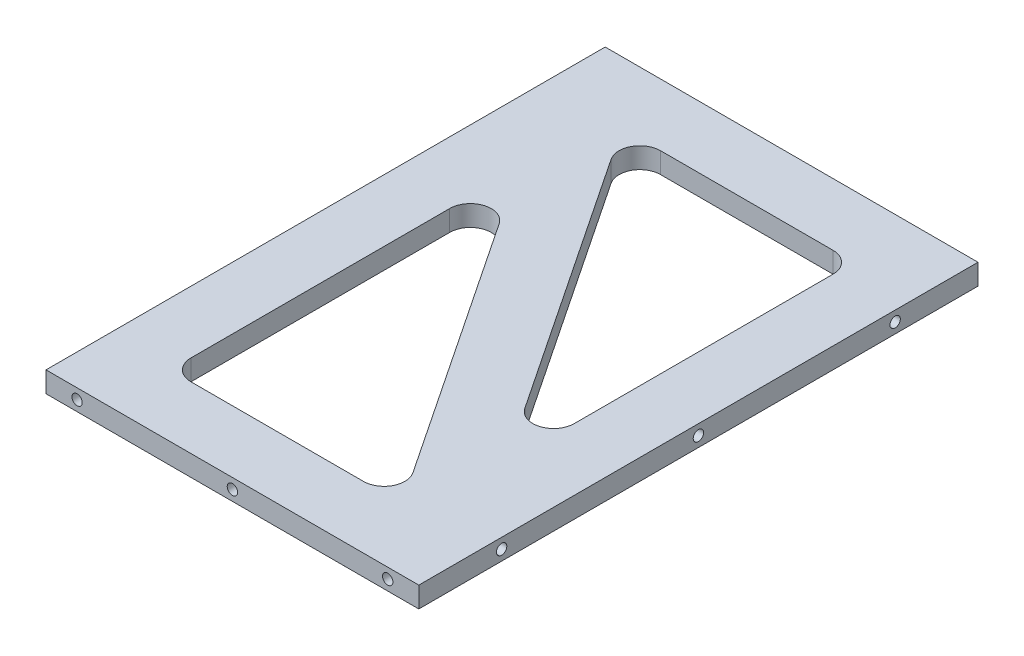
ISO-10303-21;
HEADER;
FILE_DESCRIPTION(('STEP AP214'),'2;1');
FILE_NAME('part.step','',(''),(''),'','','');
FILE_SCHEMA(('AUTOMOTIVE_DESIGN { 1 0 10303 214 1 1 1 1 }'));
ENDSEC;
DATA;
#1=APPLICATION_CONTEXT('core data for automotive mechanical design processes');
#2=APPLICATION_PROTOCOL_DEFINITION('international standard','automotive_design',2000,#1);
#3=PRODUCT_CONTEXT('',#1,'mechanical');
#4=PRODUCT('Part','Part','',(#3));
#5=PRODUCT_RELATED_PRODUCT_CATEGORY('part','',(#4));
#6=PRODUCT_DEFINITION_FORMATION('','',#4);
#7=PRODUCT_DEFINITION_CONTEXT('part definition',#1,'design');
#8=PRODUCT_DEFINITION('design','',#6,#7);
#9=PRODUCT_DEFINITION_SHAPE('','',#8);
#10=(LENGTH_UNIT() NAMED_UNIT(*) SI_UNIT(.MILLI.,.METRE.));
#11=(NAMED_UNIT(*) PLANE_ANGLE_UNIT() SI_UNIT($,.RADIAN.));
#12=(NAMED_UNIT(*) SI_UNIT($,.STERADIAN.) SOLID_ANGLE_UNIT());
#13=UNCERTAINTY_MEASURE_WITH_UNIT(LENGTH_MEASURE(1.E-05),#10,'distance_accuracy_value','');
#14=(GEOMETRIC_REPRESENTATION_CONTEXT(3) GLOBAL_UNCERTAINTY_ASSIGNED_CONTEXT((#13)) GLOBAL_UNIT_ASSIGNED_CONTEXT((#10,
#11,#12)) REPRESENTATION_CONTEXT('',''));
#15=CARTESIAN_POINT('',(0.,0.,0.));
#16=DIRECTION('',(0.,0.,1.));
#17=DIRECTION('',(1.,0.,0.));
#18=AXIS2_PLACEMENT_3D('',#15,#16,#17);
#19=CARTESIAN_POINT('',(0.,10.,0.));
#20=DIRECTION('',(1.,0.,0.));
#21=DIRECTION('',(0.,0.,-1.));
#22=AXIS2_PLACEMENT_3D('',#19,#20,#21);
#23=PLANE('',#22);
#24=DIRECTION('',(0.,0.,1.));
#25=VECTOR('',#24,1.);
#26=CARTESIAN_POINT('',(0.,0.,0.));
#27=LINE('',#26,#25);
#28=CARTESIAN_POINT('',(0.,0.,-270.));
#29=VERTEX_POINT('',#28);
#30=CARTESIAN_POINT('',(0.,0.,0.));
#31=VERTEX_POINT('',#30);
#32=EDGE_CURVE('E264',#29,#31,#27,.T.);
#33=ORIENTED_EDGE('',*,*,#32,.T.);
#34=DIRECTION('',(0.,-1.,0.));
#35=VECTOR('',#34,1.);
#36=CARTESIAN_POINT('',(0.,10.,0.));
#37=LINE('',#36,#35);
#38=CARTESIAN_POINT('',(0.,10.,0.));
#39=VERTEX_POINT('',#38);
#40=EDGE_CURVE('E298',#39,#31,#37,.T.);
#41=ORIENTED_EDGE('',*,*,#40,.F.);
#42=DIRECTION('',(0.,0.,1.));
#43=VECTOR('',#42,1.);
#44=CARTESIAN_POINT('',(0.,10.,0.));
#45=LINE('',#44,#43);
#46=CARTESIAN_POINT('',(0.,10.,-270.));
#47=VERTEX_POINT('',#46);
#48=EDGE_CURVE('E272',#47,#39,#45,.T.);
#49=ORIENTED_EDGE('',*,*,#48,.F.);
#50=DIRECTION('',(0.,-1.,0.));
#51=VECTOR('',#50,1.);
#52=CARTESIAN_POINT('',(0.,10.,-270.));
#53=LINE('',#52,#51);
#54=EDGE_CURVE('E282',#47,#29,#53,.T.);
#55=ORIENTED_EDGE('',*,*,#54,.T.);
#56=EDGE_LOOP('',(#33,#41,#49,#55));
#57=FACE_BOUND('',#56,.T.);
#58=ADVANCED_FACE('F37',(#57),#23,.F.);
#59=CARTESIAN_POINT('',(0.,10.,0.));
#60=DIRECTION('',(0.,0.,-1.));
#61=DIRECTION('',(-1.,0.,0.));
#62=AXIS2_PLACEMENT_3D('',#59,#60,#61);
#63=PLANE('',#62);
#64=CARTESIAN_POINT('',(15.,5.,0.));
#65=DIRECTION('',(0.,0.,1.));
#66=DIRECTION('',(1.,0.,0.));
#67=AXIS2_PLACEMENT_3D('',#64,#65,#66);
#68=CIRCLE('',#67,2.49999999999999);
#69=CARTESIAN_POINT('',(17.5,5.,0.));
#70=VERTEX_POINT('',#69);
#71=EDGE_CURVE('E220',#70,#70,#68,.T.);
#72=ORIENTED_EDGE('',*,*,#71,.F.);
#73=EDGE_LOOP('',(#72));
#74=FACE_BOUND('',#73,.T.);
#75=CARTESIAN_POINT('',(90.,5.,0.));
#76=DIRECTION('',(0.,0.,1.));
#77=DIRECTION('',(1.,0.,0.));
#78=AXIS2_PLACEMENT_3D('',#75,#76,#77);
#79=CIRCLE('',#78,2.49999999999999);
#80=CARTESIAN_POINT('',(92.5,5.,0.));
#81=VERTEX_POINT('',#80);
#82=EDGE_CURVE('E226',#81,#81,#79,.T.);
#83=ORIENTED_EDGE('',*,*,#82,.F.);
#84=EDGE_LOOP('',(#83));
#85=FACE_BOUND('',#84,.T.);
#86=CARTESIAN_POINT('',(165.,5.,0.));
#87=DIRECTION('',(0.,0.,1.));
#88=DIRECTION('',(1.,0.,0.));
#89=AXIS2_PLACEMENT_3D('',#86,#87,#88);
#90=CIRCLE('',#89,2.5);
#91=CARTESIAN_POINT('',(167.5,5.,0.));
#92=VERTEX_POINT('',#91);
#93=EDGE_CURVE('E232',#92,#92,#90,.T.);
#94=ORIENTED_EDGE('',*,*,#93,.F.);
#95=EDGE_LOOP('',(#94));
#96=FACE_BOUND('',#95,.T.);
#97=DIRECTION('',(1.,0.,0.));
#98=VECTOR('',#97,1.);
#99=CARTESIAN_POINT('',(0.,0.,0.));
#100=LINE('',#99,#98);
#101=CARTESIAN_POINT('',(180.,0.,0.));
#102=VERTEX_POINT('',#101);
#103=EDGE_CURVE('E285',#31,#102,#100,.T.);
#104=ORIENTED_EDGE('',*,*,#103,.T.);
#105=DIRECTION('',(0.,-1.,0.));
#106=VECTOR('',#105,1.);
#107=CARTESIAN_POINT('',(180.,10.,0.));
#108=LINE('',#107,#106);
#109=CARTESIAN_POINT('',(180.,10.,0.));
#110=VERTEX_POINT('',#109);
#111=EDGE_CURVE('E295',#110,#102,#108,.T.);
#112=ORIENTED_EDGE('',*,*,#111,.F.);
#113=DIRECTION('',(1.,0.,0.));
#114=VECTOR('',#113,1.);
#115=CARTESIAN_POINT('',(0.,10.,0.));
#116=LINE('',#115,#114);
#117=EDGE_CURVE('E275',#39,#110,#116,.T.);
#118=ORIENTED_EDGE('',*,*,#117,.F.);
#119=ORIENTED_EDGE('',*,*,#40,.T.);
#120=EDGE_LOOP('',(#104,#112,#118,#119));
#121=FACE_BOUND('',#120,.T.);
#122=ADVANCED_FACE('F390',(#74,#85,#96,#121),#63,.F.);
#123=CARTESIAN_POINT('',(180.,10.,0.));
#124=DIRECTION('',(-1.,0.,0.));
#125=DIRECTION('',(0.,0.,1.));
#126=AXIS2_PLACEMENT_3D('',#123,#124,#125);
#127=PLANE('',#126);
#128=CARTESIAN_POINT('',(180.,5.,-40.));
#129=DIRECTION('',(1.,0.,0.));
#130=DIRECTION('',(0.,0.,-1.));
#131=AXIS2_PLACEMENT_3D('',#128,#129,#130);
#132=CIRCLE('',#131,2.49999999999999);
#133=CARTESIAN_POINT('',(180.,5.,-42.5));
#134=VERTEX_POINT('',#133);
#135=EDGE_CURVE('E186',#134,#134,#132,.T.);
#136=ORIENTED_EDGE('',*,*,#135,.F.);
#137=EDGE_LOOP('',(#136));
#138=FACE_BOUND('',#137,.T.);
#139=CARTESIAN_POINT('',(180.,5.,-135.));
#140=DIRECTION('',(1.,0.,0.));
#141=DIRECTION('',(0.,0.,-1.));
#142=AXIS2_PLACEMENT_3D('',#139,#140,#141);
#143=CIRCLE('',#142,2.49999999999999);
#144=CARTESIAN_POINT('',(180.,5.,-137.5));
#145=VERTEX_POINT('',#144);
#146=EDGE_CURVE('E185',#145,#145,#143,.T.);
#147=ORIENTED_EDGE('',*,*,#146,.F.);
#148=EDGE_LOOP('',(#147));
#149=FACE_BOUND('',#148,.T.);
#150=CARTESIAN_POINT('',(180.,5.,-230.));
#151=DIRECTION('',(1.,0.,0.));
#152=DIRECTION('',(0.,0.,-1.));
#153=AXIS2_PLACEMENT_3D('',#150,#151,#152);
#154=CIRCLE('',#153,2.49999999999999);
#155=CARTESIAN_POINT('',(180.,5.,-232.5));
#156=VERTEX_POINT('',#155);
#157=EDGE_CURVE('E196',#156,#156,#154,.T.);
#158=ORIENTED_EDGE('',*,*,#157,.F.);
#159=EDGE_LOOP('',(#158));
#160=FACE_BOUND('',#159,.T.);
#161=DIRECTION('',(0.,0.,-1.));
#162=VECTOR('',#161,1.);
#163=CARTESIAN_POINT('',(180.,0.,0.));
#164=LINE('',#163,#162);
#165=CARTESIAN_POINT('',(180.,0.,-270.));
#166=VERTEX_POINT('',#165);
#167=EDGE_CURVE('E287',#102,#166,#164,.T.);
#168=ORIENTED_EDGE('',*,*,#167,.T.);
#169=DIRECTION('',(0.,-1.,0.));
#170=VECTOR('',#169,1.);
#171=CARTESIAN_POINT('',(180.,10.,-270.));
#172=LINE('',#171,#170);
#173=CARTESIAN_POINT('',(180.,10.,-270.));
#174=VERTEX_POINT('',#173);
#175=EDGE_CURVE('E292',#174,#166,#172,.T.);
#176=ORIENTED_EDGE('',*,*,#175,.F.);
#177=DIRECTION('',(0.,0.,-1.));
#178=VECTOR('',#177,1.);
#179=CARTESIAN_POINT('',(180.,10.,0.));
#180=LINE('',#179,#178);
#181=EDGE_CURVE('E278',#110,#174,#180,.T.);
#182=ORIENTED_EDGE('',*,*,#181,.F.);
#183=ORIENTED_EDGE('',*,*,#111,.T.);
#184=EDGE_LOOP('',(#168,#176,#182,#183));
#185=FACE_BOUND('',#184,.T.);
#186=ADVANCED_FACE('F396',(#138,#149,#160,#185),#127,.F.);
#187=CARTESIAN_POINT('',(0.,10.,-270.));
#188=DIRECTION('',(0.,0.,1.));
#189=DIRECTION('',(1.,0.,0.));
#190=AXIS2_PLACEMENT_3D('',#187,#188,#189);
#191=PLANE('',#190);
#192=CARTESIAN_POINT('',(165.,5.,-270.));
#193=DIRECTION('',(0.,0.,-1.));
#194=DIRECTION('',(-1.,0.,0.));
#195=AXIS2_PLACEMENT_3D('',#192,#193,#194);
#196=CIRCLE('',#195,2.5);
#197=CARTESIAN_POINT('',(162.5,5.,-270.));
#198=VERTEX_POINT('',#197);
#199=EDGE_CURVE('E202',#198,#198,#196,.T.);
#200=ORIENTED_EDGE('',*,*,#199,.F.);
#201=EDGE_LOOP('',(#200));
#202=FACE_BOUND('',#201,.T.);
#203=CARTESIAN_POINT('',(90.,5.00000000000002,-270.));
#204=DIRECTION('',(0.,0.,-1.));
#205=DIRECTION('',(-1.,0.,0.));
#206=AXIS2_PLACEMENT_3D('',#203,#204,#205);
#207=CIRCLE('',#206,2.49999999999999);
#208=CARTESIAN_POINT('',(87.5,5.00000000000002,-270.));
#209=VERTEX_POINT('',#208);
#210=EDGE_CURVE('E208',#209,#209,#207,.T.);
#211=ORIENTED_EDGE('',*,*,#210,.F.);
#212=EDGE_LOOP('',(#211));
#213=FACE_BOUND('',#212,.T.);
#214=CARTESIAN_POINT('',(15.,5.00000000000003,-270.));
#215=DIRECTION('',(0.,0.,-1.));
#216=DIRECTION('',(-1.,0.,0.));
#217=AXIS2_PLACEMENT_3D('',#214,#215,#216);
#218=CIRCLE('',#217,2.49999999999999);
#219=CARTESIAN_POINT('',(12.5,5.00000000000003,-270.));
#220=VERTEX_POINT('',#219);
#221=EDGE_CURVE('E214',#220,#220,#218,.T.);
#222=ORIENTED_EDGE('',*,*,#221,.F.);
#223=EDGE_LOOP('',(#222));
#224=FACE_BOUND('',#223,.T.);
#225=DIRECTION('',(-1.,0.,0.));
#226=VECTOR('',#225,1.);
#227=CARTESIAN_POINT('',(0.,0.,-270.));
#228=LINE('',#227,#226);
#229=EDGE_CURVE('E276',#166,#29,#228,.T.);
#230=ORIENTED_EDGE('',*,*,#229,.T.);
#231=ORIENTED_EDGE('',*,*,#54,.F.);
#232=DIRECTION('',(-1.,0.,0.));
#233=VECTOR('',#232,1.);
#234=CARTESIAN_POINT('',(0.,10.,-270.));
#235=LINE('',#234,#233);
#236=EDGE_CURVE('E280',#174,#47,#235,.T.);
#237=ORIENTED_EDGE('',*,*,#236,.F.);
#238=ORIENTED_EDGE('',*,*,#175,.T.);
#239=EDGE_LOOP('',(#230,#231,#237,#238));
#240=FACE_BOUND('',#239,.T.);
#241=ADVANCED_FACE('F402',(#202,#213,#224,#240),#191,.F.);
#242=CARTESIAN_POINT('',(0.,10.,0.));
#243=DIRECTION('',(0.,-1.,0.));
#244=DIRECTION('',(0.,0.,-1.));
#245=AXIS2_PLACEMENT_3D('',#242,#243,#244);
#246=PLANE('',#245);
#247=DIRECTION('',(0.,0.,1.));
#248=VECTOR('',#247,1.);
#249=CARTESIAN_POINT('',(30.,10.,-197.95836543402));
#250=LINE('',#249,#248);
#251=CARTESIAN_POINT('',(30.,10.,-164.9306090567));
#252=VERTEX_POINT('',#251);
#253=CARTESIAN_POINT('',(30.,10.,-40.));
#254=VERTEX_POINT('',#253);
#255=EDGE_CURVE('E250',#252,#254,#250,.T.);
#256=ORIENTED_EDGE('',*,*,#255,.F.);
#257=CARTESIAN_POINT('',(40.,10.,-164.9306090567));
#258=DIRECTION('',(0.,-1.,0.));
#259=DIRECTION('',(0.,0.,-1.));
#260=AXIS2_PLACEMENT_3D('',#257,#258,#259);
#261=CIRCLE('',#260,10.);
#262=CARTESIAN_POINT('',(48.3205029433784,10.,-170.477611018952));
#263=VERTEX_POINT('',#262);
#264=EDGE_CURVE('E334',#252,#263,#261,.T.);
#265=ORIENTED_EDGE('',*,*,#264,.T.);
#266=DIRECTION('',(-0.554700196225229,0.,-0.832050294337844));
#267=VECTOR('',#266,1.);
#268=CARTESIAN_POINT('',(141.97224362268,10.,-30.));
#269=LINE('',#268,#267);
#270=CARTESIAN_POINT('',(131.607575647845,10.,-45.5470019622523));
#271=VERTEX_POINT('',#270);
#272=EDGE_CURVE('E238',#271,#263,#269,.T.);
#273=ORIENTED_EDGE('',*,*,#272,.F.);
#274=CARTESIAN_POINT('',(123.287072704467,10.,-40.));
#275=DIRECTION('',(0.,-1.,0.));
#276=DIRECTION('',(0.,0.,-1.));
#277=AXIS2_PLACEMENT_3D('',#274,#275,#276);
#278=CIRCLE('',#277,10.);
#279=CARTESIAN_POINT('',(123.287072704467,10.,-30.));
#280=VERTEX_POINT('',#279);
#281=EDGE_CURVE('E346',#271,#280,#278,.T.);
#282=ORIENTED_EDGE('',*,*,#281,.T.);
#283=DIRECTION('',(1.,0.,0.));
#284=VECTOR('',#283,1.);
#285=CARTESIAN_POINT('',(30.,10.,-30.));
#286=LINE('',#285,#284);
#287=CARTESIAN_POINT('',(40.,10.,-30.));
#288=VERTEX_POINT('',#287);
#289=EDGE_CURVE('E243',#288,#280,#286,.T.);
#290=ORIENTED_EDGE('',*,*,#289,.F.);
#291=CARTESIAN_POINT('',(40.,10.,-40.));
#292=DIRECTION('',(0.,-1.,0.));
#293=DIRECTION('',(0.,0.,-1.));
#294=AXIS2_PLACEMENT_3D('',#291,#292,#293);
#295=CIRCLE('',#294,10.);
#296=EDGE_CURVE('E45',#288,#254,#295,.T.);
#297=ORIENTED_EDGE('',*,*,#296,.T.);
#298=EDGE_LOOP('',(#256,#265,#273,#282,#290,#297));
#299=FACE_BOUND('',#298,.T.);
#300=DIRECTION('',(0.,0.,-1.));
#301=VECTOR('',#300,1.);
#302=CARTESIAN_POINT('',(150.,10.,-240.));
#303=LINE('',#302,#301);
#304=CARTESIAN_POINT('',(150.,10.,-105.0693909433));
#305=VERTEX_POINT('',#304);
#306=CARTESIAN_POINT('',(150.,10.,-230.));
#307=VERTEX_POINT('',#306);
#308=EDGE_CURVE('E267',#305,#307,#303,.T.);
#309=ORIENTED_EDGE('',*,*,#308,.F.);
#310=CARTESIAN_POINT('',(140.,10.,-105.0693909433));
#311=DIRECTION('',(0.,-1.,0.));
#312=DIRECTION('',(0.,0.,-1.));
#313=AXIS2_PLACEMENT_3D('',#310,#311,#312);
#314=CIRCLE('',#313,10.);
#315=CARTESIAN_POINT('',(131.679497056622,10.,-99.5223889810476));
#316=VERTEX_POINT('',#315);
#317=EDGE_CURVE('E342',#305,#316,#314,.T.);
#318=ORIENTED_EDGE('',*,*,#317,.T.);
#319=DIRECTION('',(0.554700196225229,0.,0.832050294337843));
#320=VECTOR('',#319,1.);
#321=CARTESIAN_POINT('',(150.,10.,-72.0416345659799));
#322=LINE('',#321,#320);
#323=CARTESIAN_POINT('',(48.3924243521548,10.,-224.452998037748));
#324=VERTEX_POINT('',#323);
#325=EDGE_CURVE('E247',#324,#316,#322,.T.);
#326=ORIENTED_EDGE('',*,*,#325,.F.);
#327=CARTESIAN_POINT('',(56.7129272955332,10.,-230.));
#328=DIRECTION('',(0.,-1.,0.));
#329=DIRECTION('',(0.,0.,-1.));
#330=AXIS2_PLACEMENT_3D('',#327,#328,#329);
#331=CIRCLE('',#330,10.);
#332=CARTESIAN_POINT('',(56.7129272955332,10.,-240.));
#333=VERTEX_POINT('',#332);
#334=EDGE_CURVE('E330',#324,#333,#331,.T.);
#335=ORIENTED_EDGE('',*,*,#334,.T.);
#336=DIRECTION('',(-1.,0.,0.));
#337=VECTOR('',#336,1.);
#338=CARTESIAN_POINT('',(38.0277563773199,10.,-240.));
#339=LINE('',#338,#337);
#340=CARTESIAN_POINT('',(140.,10.,-240.));
#341=VERTEX_POINT('',#340);
#342=EDGE_CURVE('E258',#341,#333,#339,.T.);
#343=ORIENTED_EDGE('',*,*,#342,.F.);
#344=CARTESIAN_POINT('',(140.,10.,-230.));
#345=DIRECTION('',(0.,-1.,0.));
#346=DIRECTION('',(0.,0.,-1.));
#347=AXIS2_PLACEMENT_3D('',#344,#345,#346);
#348=CIRCLE('',#347,10.);
#349=EDGE_CURVE('E338',#341,#307,#348,.T.);
#350=ORIENTED_EDGE('',*,*,#349,.T.);
#351=EDGE_LOOP('',(#309,#318,#326,#335,#343,#350));
#352=FACE_BOUND('',#351,.T.);
#353=ORIENTED_EDGE('',*,*,#48,.T.);
#354=ORIENTED_EDGE('',*,*,#117,.T.);
#355=ORIENTED_EDGE('',*,*,#181,.T.);
#356=ORIENTED_EDGE('',*,*,#236,.T.);
#357=EDGE_LOOP('',(#353,#354,#355,#356));
#358=FACE_BOUND('',#357,.T.);
#359=ADVANCED_FACE('F352',(#299,#352,#358),#246,.F.);
#360=CARTESIAN_POINT('',(0.,0.,0.));
#361=DIRECTION('',(0.,-1.,0.));
#362=DIRECTION('',(0.,0.,-1.));
#363=AXIS2_PLACEMENT_3D('',#360,#361,#362);
#364=PLANE('',#363);
#365=DIRECTION('',(1.,0.,0.));
#366=VECTOR('',#365,1.);
#367=CARTESIAN_POINT('',(30.,0.,-30.));
#368=LINE('',#367,#366);
#369=CARTESIAN_POINT('',(40.,0.,-30.));
#370=VERTEX_POINT('',#369);
#371=CARTESIAN_POINT('',(123.287072704467,0.,-30.));
#372=VERTEX_POINT('',#371);
#373=EDGE_CURVE('E245',#370,#372,#368,.T.);
#374=ORIENTED_EDGE('',*,*,#373,.T.);
#375=CARTESIAN_POINT('',(123.287072704467,0.,-40.));
#376=DIRECTION('',(0.,-1.,0.));
#377=DIRECTION('',(0.,0.,-1.));
#378=AXIS2_PLACEMENT_3D('',#375,#376,#377);
#379=CIRCLE('',#378,10.);
#380=CARTESIAN_POINT('',(131.607575647845,0.,-45.5470019622523));
#381=VERTEX_POINT('',#380);
#382=EDGE_CURVE('E348',#372,#381,#379,.F.);
#383=ORIENTED_EDGE('',*,*,#382,.T.);
#384=DIRECTION('',(-0.554700196225229,0.,-0.832050294337844));
#385=VECTOR('',#384,1.);
#386=CARTESIAN_POINT('',(141.97224362268,0.,-30.));
#387=LINE('',#386,#385);
#388=CARTESIAN_POINT('',(48.3205029433784,0.,-170.477611018952));
#389=VERTEX_POINT('',#388);
#390=EDGE_CURVE('E239',#381,#389,#387,.T.);
#391=ORIENTED_EDGE('',*,*,#390,.T.);
#392=CARTESIAN_POINT('',(40.,0.,-164.9306090567));
#393=DIRECTION('',(0.,-1.,0.));
#394=DIRECTION('',(0.,0.,-1.));
#395=AXIS2_PLACEMENT_3D('',#392,#393,#394);
#396=CIRCLE('',#395,10.);
#397=CARTESIAN_POINT('',(30.,0.,-164.9306090567));
#398=VERTEX_POINT('',#397);
#399=EDGE_CURVE('E336',#389,#398,#396,.F.);
#400=ORIENTED_EDGE('',*,*,#399,.T.);
#401=DIRECTION('',(0.,0.,1.));
#402=VECTOR('',#401,1.);
#403=CARTESIAN_POINT('',(30.,0.,-197.95836543402));
#404=LINE('',#403,#402);
#405=CARTESIAN_POINT('',(30.,0.,-40.));
#406=VERTEX_POINT('',#405);
#407=EDGE_CURVE('E242',#398,#406,#404,.T.);
#408=ORIENTED_EDGE('',*,*,#407,.T.);
#409=CARTESIAN_POINT('',(40.,0.,-40.));
#410=DIRECTION('',(0.,-1.,0.));
#411=DIRECTION('',(0.,0.,-1.));
#412=AXIS2_PLACEMENT_3D('',#409,#410,#411);
#413=CIRCLE('',#412,10.);
#414=EDGE_CURVE('E11',#406,#370,#413,.F.);
#415=ORIENTED_EDGE('',*,*,#414,.T.);
#416=EDGE_LOOP('',(#374,#383,#391,#400,#408,#415));
#417=FACE_BOUND('',#416,.T.);
#418=DIRECTION('',(-1.,0.,0.));
#419=VECTOR('',#418,1.);
#420=CARTESIAN_POINT('',(38.0277563773199,0.,-240.));
#421=LINE('',#420,#419);
#422=CARTESIAN_POINT('',(140.,0.,-240.));
#423=VERTEX_POINT('',#422);
#424=CARTESIAN_POINT('',(56.7129272955332,0.,-240.));
#425=VERTEX_POINT('',#424);
#426=EDGE_CURVE('E261',#423,#425,#421,.T.);
#427=ORIENTED_EDGE('',*,*,#426,.T.);
#428=CARTESIAN_POINT('',(56.7129272955332,0.,-230.));
#429=DIRECTION('',(0.,-1.,0.));
#430=DIRECTION('',(0.,0.,-1.));
#431=AXIS2_PLACEMENT_3D('',#428,#429,#430);
#432=CIRCLE('',#431,10.);
#433=CARTESIAN_POINT('',(48.3924243521548,0.,-224.452998037748));
#434=VERTEX_POINT('',#433);
#435=EDGE_CURVE('E332',#425,#434,#432,.F.);
#436=ORIENTED_EDGE('',*,*,#435,.T.);
#437=DIRECTION('',(0.554700196225229,0.,0.832050294337843));
#438=VECTOR('',#437,1.);
#439=CARTESIAN_POINT('',(150.,0.,-72.0416345659799));
#440=LINE('',#439,#438);
#441=CARTESIAN_POINT('',(131.679497056622,0.,-99.5223889810476));
#442=VERTEX_POINT('',#441);
#443=EDGE_CURVE('E254',#434,#442,#440,.T.);
#444=ORIENTED_EDGE('',*,*,#443,.T.);
#445=CARTESIAN_POINT('',(140.,0.,-105.0693909433));
#446=DIRECTION('',(0.,-1.,0.));
#447=DIRECTION('',(0.,0.,-1.));
#448=AXIS2_PLACEMENT_3D('',#445,#446,#447);
#449=CIRCLE('',#448,10.);
#450=CARTESIAN_POINT('',(150.,0.,-105.0693909433));
#451=VERTEX_POINT('',#450);
#452=EDGE_CURVE('E344',#442,#451,#449,.F.);
#453=ORIENTED_EDGE('',*,*,#452,.T.);
#454=DIRECTION('',(0.,0.,-1.));
#455=VECTOR('',#454,1.);
#456=CARTESIAN_POINT('',(150.,0.,-240.));
#457=LINE('',#456,#455);
#458=CARTESIAN_POINT('',(150.,0.,-230.));
#459=VERTEX_POINT('',#458);
#460=EDGE_CURVE('E257',#451,#459,#457,.T.);
#461=ORIENTED_EDGE('',*,*,#460,.T.);
#462=CARTESIAN_POINT('',(140.,0.,-230.));
#463=DIRECTION('',(0.,-1.,0.));
#464=DIRECTION('',(0.,0.,-1.));
#465=AXIS2_PLACEMENT_3D('',#462,#463,#464);
#466=CIRCLE('',#465,10.);
#467=EDGE_CURVE('E340',#459,#423,#466,.F.);
#468=ORIENTED_EDGE('',*,*,#467,.T.);
#469=EDGE_LOOP('',(#427,#436,#444,#453,#461,#468));
#470=FACE_BOUND('',#469,.T.);
#471=ORIENTED_EDGE('',*,*,#32,.F.);
#472=ORIENTED_EDGE('',*,*,#229,.F.);
#473=ORIENTED_EDGE('',*,*,#167,.F.);
#474=ORIENTED_EDGE('',*,*,#103,.F.);
#475=EDGE_LOOP('',(#471,#472,#473,#474));
#476=FACE_BOUND('',#475,.T.);
#477=ADVANCED_FACE('F363',(#417,#470,#476),#364,.T.);
#478=CARTESIAN_POINT('',(150.,0.,-72.0416345659799));
#479=DIRECTION('',(-0.832050294337843,0.,0.554700196225229));
#480=DIRECTION('',(0.554700196225229,0.,0.832050294337843));
#481=AXIS2_PLACEMENT_3D('',#478,#479,#480);
#482=PLANE('',#481);
#483=ORIENTED_EDGE('',*,*,#443,.F.);
#484=DIRECTION('',(0.,1.,0.));
#485=VECTOR('',#484,1.);
#486=CARTESIAN_POINT('',(48.3924243521547,10.,-224.452998037748));
#487=LINE('',#486,#485);
#488=EDGE_CURVE('E303',#434,#324,#487,.T.);
#489=ORIENTED_EDGE('',*,*,#488,.T.);
#490=ORIENTED_EDGE('',*,*,#325,.T.);
#491=DIRECTION('',(0.,1.,0.));
#492=VECTOR('',#491,1.);
#493=CARTESIAN_POINT('',(131.679497056622,0.,-99.5223889810476));
#494=LINE('',#493,#492);
#495=EDGE_CURVE('E301',#316,#442,#494,.F.);
#496=ORIENTED_EDGE('',*,*,#495,.T.);
#497=EDGE_LOOP('',(#483,#489,#490,#496));
#498=FACE_BOUND('',#497,.T.);
#499=ADVANCED_FACE('F409',(#498),#482,.F.);
#500=CARTESIAN_POINT('',(38.0277563773199,0.,-240.));
#501=DIRECTION('',(0.,0.,-1.));
#502=DIRECTION('',(-1.,0.,0.));
#503=AXIS2_PLACEMENT_3D('',#500,#501,#502);
#504=PLANE('',#503);
#505=ORIENTED_EDGE('',*,*,#342,.T.);
#506=DIRECTION('',(0.,1.,0.));
#507=VECTOR('',#506,1.);
#508=CARTESIAN_POINT('',(56.7129272955332,0.,-240.));
#509=LINE('',#508,#507);
#510=EDGE_CURVE('E309',#333,#425,#509,.F.);
#511=ORIENTED_EDGE('',*,*,#510,.T.);
#512=ORIENTED_EDGE('',*,*,#426,.F.);
#513=DIRECTION('',(0.,1.,0.));
#514=VECTOR('',#513,1.);
#515=CARTESIAN_POINT('',(140.,10.,-240.));
#516=LINE('',#515,#514);
#517=EDGE_CURVE('E306',#423,#341,#516,.T.);
#518=ORIENTED_EDGE('',*,*,#517,.T.);
#519=EDGE_LOOP('',(#505,#511,#512,#518));
#520=FACE_BOUND('',#519,.T.);
#521=ADVANCED_FACE('F414',(#520),#504,.F.);
#522=CARTESIAN_POINT('',(150.,0.,-240.));
#523=DIRECTION('',(1.,0.,0.));
#524=DIRECTION('',(0.,0.,-1.));
#525=AXIS2_PLACEMENT_3D('',#522,#523,#524);
#526=PLANE('',#525);
#527=ORIENTED_EDGE('',*,*,#308,.T.);
#528=DIRECTION('',(0.,1.,0.));
#529=VECTOR('',#528,1.);
#530=CARTESIAN_POINT('',(150.,0.,-230.));
#531=LINE('',#530,#529);
#532=EDGE_CURVE('E324',#307,#459,#531,.F.);
#533=ORIENTED_EDGE('',*,*,#532,.T.);
#534=ORIENTED_EDGE('',*,*,#460,.F.);
#535=DIRECTION('',(0.,1.,0.));
#536=VECTOR('',#535,1.);
#537=CARTESIAN_POINT('',(150.,10.,-105.0693909433));
#538=LINE('',#537,#536);
#539=EDGE_CURVE('E321',#451,#305,#538,.T.);
#540=ORIENTED_EDGE('',*,*,#539,.T.);
#541=EDGE_LOOP('',(#527,#533,#534,#540));
#542=FACE_BOUND('',#541,.T.);
#543=ADVANCED_FACE('F416',(#542),#526,.F.);
#544=CARTESIAN_POINT('',(141.97224362268,0.,-30.));
#545=DIRECTION('',(0.832050294337844,0.,-0.554700196225229));
#546=DIRECTION('',(-0.554700196225229,0.,-0.832050294337844));
#547=AXIS2_PLACEMENT_3D('',#544,#545,#546);
#548=PLANE('',#547);
#549=ORIENTED_EDGE('',*,*,#272,.T.);
#550=DIRECTION('',(0.,1.,0.));
#551=VECTOR('',#550,1.);
#552=CARTESIAN_POINT('',(48.3205029433785,0.,-170.477611018952));
#553=LINE('',#552,#551);
#554=EDGE_CURVE('E319',#263,#389,#553,.F.);
#555=ORIENTED_EDGE('',*,*,#554,.T.);
#556=ORIENTED_EDGE('',*,*,#390,.F.);
#557=DIRECTION('',(0.,1.,0.));
#558=VECTOR('',#557,1.);
#559=CARTESIAN_POINT('',(131.607575647845,10.,-45.5470019622523));
#560=LINE('',#559,#558);
#561=EDGE_CURVE('E316',#381,#271,#560,.T.);
#562=ORIENTED_EDGE('',*,*,#561,.T.);
#563=EDGE_LOOP('',(#549,#555,#556,#562));
#564=FACE_BOUND('',#563,.T.);
#565=ADVANCED_FACE('F371',(#564),#548,.F.);
#566=CARTESIAN_POINT('',(30.,0.,-30.));
#567=DIRECTION('',(0.,0.,1.));
#568=DIRECTION('',(1.,0.,0.));
#569=AXIS2_PLACEMENT_3D('',#566,#567,#568);
#570=PLANE('',#569);
#571=ORIENTED_EDGE('',*,*,#289,.T.);
#572=DIRECTION('',(0.,1.,0.));
#573=VECTOR('',#572,1.);
#574=CARTESIAN_POINT('',(123.287072704467,0.,-30.));
#575=LINE('',#574,#573);
#576=EDGE_CURVE('E52',#280,#372,#575,.F.);
#577=ORIENTED_EDGE('',*,*,#576,.T.);
#578=ORIENTED_EDGE('',*,*,#373,.F.);
#579=DIRECTION('',(0.,1.,0.));
#580=VECTOR('',#579,1.);
#581=CARTESIAN_POINT('',(40.,10.,-30.));
#582=LINE('',#581,#580);
#583=EDGE_CURVE('E326',#370,#288,#582,.T.);
#584=ORIENTED_EDGE('',*,*,#583,.T.);
#585=EDGE_LOOP('',(#571,#577,#578,#584));
#586=FACE_BOUND('',#585,.T.);
#587=ADVANCED_FACE('F361',(#586),#570,.F.);
#588=CARTESIAN_POINT('',(30.,0.,-197.95836543402));
#589=DIRECTION('',(-1.,0.,0.));
#590=DIRECTION('',(0.,0.,1.));
#591=AXIS2_PLACEMENT_3D('',#588,#589,#590);
#592=PLANE('',#591);
#593=ORIENTED_EDGE('',*,*,#407,.F.);
#594=DIRECTION('',(0.,1.,0.));
#595=VECTOR('',#594,1.);
#596=CARTESIAN_POINT('',(30.,10.,-164.9306090567));
#597=LINE('',#596,#595);
#598=EDGE_CURVE('E313',#398,#252,#597,.T.);
#599=ORIENTED_EDGE('',*,*,#598,.T.);
#600=ORIENTED_EDGE('',*,*,#255,.T.);
#601=DIRECTION('',(0.,1.,0.));
#602=VECTOR('',#601,1.);
#603=CARTESIAN_POINT('',(30.,0.,-40.));
#604=LINE('',#603,#602);
#605=EDGE_CURVE('E311',#254,#406,#604,.F.);
#606=ORIENTED_EDGE('',*,*,#605,.T.);
#607=EDGE_LOOP('',(#593,#599,#600,#606));
#608=FACE_BOUND('',#607,.T.);
#609=ADVANCED_FACE('F359',(#608),#592,.F.);
#610=CARTESIAN_POINT('',(56.7129272955332,0.,-230.));
#611=DIRECTION('',(0.,-1.,0.));
#612=DIRECTION('',(0.,0.,-1.));
#613=AXIS2_PLACEMENT_3D('',#610,#611,#612);
#614=CYLINDRICAL_SURFACE('',#613,10.);
#615=ORIENTED_EDGE('',*,*,#435,.F.);
#616=ORIENTED_EDGE('',*,*,#510,.F.);
#617=ORIENTED_EDGE('',*,*,#334,.F.);
#618=ORIENTED_EDGE('',*,*,#488,.F.);
#619=EDGE_LOOP('',(#615,#616,#617,#618));
#620=FACE_BOUND('',#619,.T.);
#621=ADVANCED_FACE('F378',(#620),#614,.F.);
#622=CARTESIAN_POINT('',(40.,0.,-164.9306090567));
#623=DIRECTION('',(0.,-1.,0.));
#624=DIRECTION('',(0.,0.,-1.));
#625=AXIS2_PLACEMENT_3D('',#622,#623,#624);
#626=CYLINDRICAL_SURFACE('',#625,10.);
#627=ORIENTED_EDGE('',*,*,#399,.F.);
#628=ORIENTED_EDGE('',*,*,#554,.F.);
#629=ORIENTED_EDGE('',*,*,#264,.F.);
#630=ORIENTED_EDGE('',*,*,#598,.F.);
#631=EDGE_LOOP('',(#627,#628,#629,#630));
#632=FACE_BOUND('',#631,.T.);
#633=ADVANCED_FACE('F375',(#632),#626,.F.);
#634=CARTESIAN_POINT('',(140.,0.,-230.));
#635=DIRECTION('',(0.,-1.,0.));
#636=DIRECTION('',(0.,0.,-1.));
#637=AXIS2_PLACEMENT_3D('',#634,#635,#636);
#638=CYLINDRICAL_SURFACE('',#637,10.);
#639=ORIENTED_EDGE('',*,*,#467,.F.);
#640=ORIENTED_EDGE('',*,*,#532,.F.);
#641=ORIENTED_EDGE('',*,*,#349,.F.);
#642=ORIENTED_EDGE('',*,*,#517,.F.);
#643=EDGE_LOOP('',(#639,#640,#641,#642));
#644=FACE_BOUND('',#643,.T.);
#645=ADVANCED_FACE('F377',(#644),#638,.F.);
#646=CARTESIAN_POINT('',(140.,0.,-105.0693909433));
#647=DIRECTION('',(0.,-1.,0.));
#648=DIRECTION('',(0.,0.,-1.));
#649=AXIS2_PLACEMENT_3D('',#646,#647,#648);
#650=CYLINDRICAL_SURFACE('',#649,10.);
#651=ORIENTED_EDGE('',*,*,#452,.F.);
#652=ORIENTED_EDGE('',*,*,#495,.F.);
#653=ORIENTED_EDGE('',*,*,#317,.F.);
#654=ORIENTED_EDGE('',*,*,#539,.F.);
#655=EDGE_LOOP('',(#651,#652,#653,#654));
#656=FACE_BOUND('',#655,.T.);
#657=ADVANCED_FACE('F384',(#656),#650,.F.);
#658=CARTESIAN_POINT('',(123.287072704467,0.,-40.));
#659=DIRECTION('',(0.,-1.,0.));
#660=DIRECTION('',(0.,0.,-1.));
#661=AXIS2_PLACEMENT_3D('',#658,#659,#660);
#662=CYLINDRICAL_SURFACE('',#661,10.);
#663=ORIENTED_EDGE('',*,*,#382,.F.);
#664=ORIENTED_EDGE('',*,*,#576,.F.);
#665=ORIENTED_EDGE('',*,*,#281,.F.);
#666=ORIENTED_EDGE('',*,*,#561,.F.);
#667=EDGE_LOOP('',(#663,#664,#665,#666));
#668=FACE_BOUND('',#667,.T.);
#669=ADVANCED_FACE('F368',(#668),#662,.F.);
#670=CARTESIAN_POINT('',(40.,0.,-40.));
#671=DIRECTION('',(0.,-1.,0.));
#672=DIRECTION('',(0.,0.,-1.));
#673=AXIS2_PLACEMENT_3D('',#670,#671,#672);
#674=CYLINDRICAL_SURFACE('',#673,10.);
#675=ORIENTED_EDGE('',*,*,#414,.F.);
#676=ORIENTED_EDGE('',*,*,#605,.F.);
#677=ORIENTED_EDGE('',*,*,#296,.F.);
#678=ORIENTED_EDGE('',*,*,#583,.F.);
#679=EDGE_LOOP('',(#675,#676,#677,#678));
#680=FACE_BOUND('',#679,.T.);
#681=ADVANCED_FACE('F39',(#680),#674,.F.);
#682=CARTESIAN_POINT('',(165.,5.,-23.));
#683=DIRECTION('',(0.,0.,1.));
#684=DIRECTION('',(1.,0.,0.));
#685=AXIS2_PLACEMENT_3D('',#682,#683,#684);
#686=CONICAL_SURFACE('',#685,2.5,1.02974425867666);
#687=CARTESIAN_POINT('',(165.,5.,-24.5021515475689));
#688=VERTEX_POINT('',#687);
#689=VERTEX_LOOP('',#688);
#690=FACE_BOUND('',#689,.T.);
#691=CARTESIAN_POINT('',(165.,5.,-23.));
#692=DIRECTION('',(0.,0.,1.));
#693=DIRECTION('',(1.,0.,0.));
#694=AXIS2_PLACEMENT_3D('',#691,#692,#693);
#695=CIRCLE('',#694,2.5);
#696=CARTESIAN_POINT('',(167.5,5.,-23.));
#697=VERTEX_POINT('',#696);
#698=EDGE_CURVE('E235',#697,#697,#695,.T.);
#699=ORIENTED_EDGE('',*,*,#698,.T.);
#700=EDGE_LOOP('',(#699));
#701=FACE_BOUND('',#700,.T.);
#702=ADVANCED_FACE('F429',(#690,#701),#686,.F.);
#703=CARTESIAN_POINT('',(165.,5.,0.));
#704=DIRECTION('',(0.,0.,1.));
#705=DIRECTION('',(1.,0.,0.));
#706=AXIS2_PLACEMENT_3D('',#703,#704,#705);
#707=CYLINDRICAL_SURFACE('',#706,2.5);
#708=ORIENTED_EDGE('',*,*,#698,.F.);
#709=EDGE_LOOP('',(#708));
#710=FACE_BOUND('',#709,.T.);
#711=ORIENTED_EDGE('',*,*,#93,.T.);
#712=EDGE_LOOP('',(#711));
#713=FACE_BOUND('',#712,.T.);
#714=ADVANCED_FACE('F432',(#710,#713),#707,.F.);
#715=CARTESIAN_POINT('',(90.,5.,-23.));
#716=DIRECTION('',(0.,0.,1.));
#717=DIRECTION('',(1.,0.,0.));
#718=AXIS2_PLACEMENT_3D('',#715,#716,#717);
#719=CONICAL_SURFACE('',#718,2.49999999999999,1.02974425867665);
#720=CARTESIAN_POINT('',(90.,5.,-24.5021515475689));
#721=VERTEX_POINT('',#720);
#722=VERTEX_LOOP('',#721);
#723=FACE_BOUND('',#722,.T.);
#724=CARTESIAN_POINT('',(90.,5.,-23.));
#725=DIRECTION('',(0.,0.,1.));
#726=DIRECTION('',(1.,0.,0.));
#727=AXIS2_PLACEMENT_3D('',#724,#725,#726);
#728=CIRCLE('',#727,2.49999999999999);
#729=CARTESIAN_POINT('',(92.5,5.,-23.));
#730=VERTEX_POINT('',#729);
#731=EDGE_CURVE('E229',#730,#730,#728,.T.);
#732=ORIENTED_EDGE('',*,*,#731,.T.);
#733=EDGE_LOOP('',(#732));
#734=FACE_BOUND('',#733,.T.);
#735=ADVANCED_FACE('F436',(#723,#734),#719,.F.);
#736=CARTESIAN_POINT('',(90.,5.,0.));
#737=DIRECTION('',(0.,0.,1.));
#738=DIRECTION('',(1.,0.,0.));
#739=AXIS2_PLACEMENT_3D('',#736,#737,#738);
#740=CYLINDRICAL_SURFACE('',#739,2.49999999999999);
#741=ORIENTED_EDGE('',*,*,#731,.F.);
#742=EDGE_LOOP('',(#741));
#743=FACE_BOUND('',#742,.T.);
#744=ORIENTED_EDGE('',*,*,#82,.T.);
#745=EDGE_LOOP('',(#744));
#746=FACE_BOUND('',#745,.T.);
#747=ADVANCED_FACE('F440',(#743,#746),#740,.F.);
#748=CARTESIAN_POINT('',(15.,5.,-23.));
#749=DIRECTION('',(0.,0.,1.));
#750=DIRECTION('',(1.,0.,0.));
#751=AXIS2_PLACEMENT_3D('',#748,#749,#750);
#752=CONICAL_SURFACE('',#751,2.5,1.02974425867665);
#753=CARTESIAN_POINT('',(15.,5.,-24.5021515475689));
#754=VERTEX_POINT('',#753);
#755=VERTEX_LOOP('',#754);
#756=FACE_BOUND('',#755,.T.);
#757=CARTESIAN_POINT('',(15.,5.,-23.));
#758=DIRECTION('',(0.,0.,1.));
#759=DIRECTION('',(1.,0.,0.));
#760=AXIS2_PLACEMENT_3D('',#757,#758,#759);
#761=CIRCLE('',#760,2.5);
#762=CARTESIAN_POINT('',(17.5,5.,-23.));
#763=VERTEX_POINT('',#762);
#764=EDGE_CURVE('E223',#763,#763,#761,.T.);
#765=ORIENTED_EDGE('',*,*,#764,.T.);
#766=EDGE_LOOP('',(#765));
#767=FACE_BOUND('',#766,.T.);
#768=ADVANCED_FACE('F444',(#756,#767),#752,.F.);
#769=CARTESIAN_POINT('',(15.,5.,0.));
#770=DIRECTION('',(0.,0.,1.));
#771=DIRECTION('',(1.,0.,0.));
#772=AXIS2_PLACEMENT_3D('',#769,#770,#771);
#773=CYLINDRICAL_SURFACE('',#772,2.49999999999999);
#774=ORIENTED_EDGE('',*,*,#764,.F.);
#775=EDGE_LOOP('',(#774));
#776=FACE_BOUND('',#775,.T.);
#777=ORIENTED_EDGE('',*,*,#71,.T.);
#778=EDGE_LOOP('',(#777));
#779=FACE_BOUND('',#778,.T.);
#780=ADVANCED_FACE('F448',(#776,#779),#773,.F.);
#781=CARTESIAN_POINT('',(15.,5.00000000000003,-250.));
#782=DIRECTION('',(0.,0.,-1.));
#783=DIRECTION('',(-1.,0.,0.));
#784=AXIS2_PLACEMENT_3D('',#781,#782,#783);
#785=CONICAL_SURFACE('',#784,2.5,1.02974425867666);
#786=CARTESIAN_POINT('',(15.,5.00000000000003,-248.497848452431));
#787=VERTEX_POINT('',#786);
#788=VERTEX_LOOP('',#787);
#789=FACE_BOUND('',#788,.T.);
#790=CARTESIAN_POINT('',(15.,5.00000000000003,-250.));
#791=DIRECTION('',(0.,0.,-1.));
#792=DIRECTION('',(-1.,0.,0.));
#793=AXIS2_PLACEMENT_3D('',#790,#791,#792);
#794=CIRCLE('',#793,2.5);
#795=CARTESIAN_POINT('',(12.5,5.00000000000003,-250.));
#796=VERTEX_POINT('',#795);
#797=EDGE_CURVE('E217',#796,#796,#794,.T.);
#798=ORIENTED_EDGE('',*,*,#797,.T.);
#799=EDGE_LOOP('',(#798));
#800=FACE_BOUND('',#799,.T.);
#801=ADVANCED_FACE('F452',(#789,#800),#785,.F.);
#802=CARTESIAN_POINT('',(15.,5.00000000000003,-270.));
#803=DIRECTION('',(0.,0.,-1.));
#804=DIRECTION('',(-1.,0.,0.));
#805=AXIS2_PLACEMENT_3D('',#802,#803,#804);
#806=CYLINDRICAL_SURFACE('',#805,2.49999999999999);
#807=ORIENTED_EDGE('',*,*,#797,.F.);
#808=EDGE_LOOP('',(#807));
#809=FACE_BOUND('',#808,.T.);
#810=ORIENTED_EDGE('',*,*,#221,.T.);
#811=EDGE_LOOP('',(#810));
#812=FACE_BOUND('',#811,.T.);
#813=ADVANCED_FACE('F456',(#809,#812),#806,.F.);
#814=CARTESIAN_POINT('',(90.,5.00000000000002,-250.));
#815=DIRECTION('',(0.,0.,-1.));
#816=DIRECTION('',(-1.,0.,0.));
#817=AXIS2_PLACEMENT_3D('',#814,#815,#816);
#818=CONICAL_SURFACE('',#817,2.5,1.02974425867666);
#819=CARTESIAN_POINT('',(90.,5.00000000000002,-248.497848452431));
#820=VERTEX_POINT('',#819);
#821=VERTEX_LOOP('',#820);
#822=FACE_BOUND('',#821,.T.);
#823=CARTESIAN_POINT('',(90.,5.00000000000002,-250.));
#824=DIRECTION('',(0.,0.,-1.));
#825=DIRECTION('',(-1.,0.,0.));
#826=AXIS2_PLACEMENT_3D('',#823,#824,#825);
#827=CIRCLE('',#826,2.5);
#828=CARTESIAN_POINT('',(87.5,5.00000000000002,-250.));
#829=VERTEX_POINT('',#828);
#830=EDGE_CURVE('E211',#829,#829,#827,.T.);
#831=ORIENTED_EDGE('',*,*,#830,.T.);
#832=EDGE_LOOP('',(#831));
#833=FACE_BOUND('',#832,.T.);
#834=ADVANCED_FACE('F460',(#822,#833),#818,.F.);
#835=CARTESIAN_POINT('',(90.,5.00000000000002,-270.));
#836=DIRECTION('',(0.,0.,-1.));
#837=DIRECTION('',(-1.,0.,0.));
#838=AXIS2_PLACEMENT_3D('',#835,#836,#837);
#839=CYLINDRICAL_SURFACE('',#838,2.5);
#840=ORIENTED_EDGE('',*,*,#830,.F.);
#841=EDGE_LOOP('',(#840));
#842=FACE_BOUND('',#841,.T.);
#843=ORIENTED_EDGE('',*,*,#210,.T.);
#844=EDGE_LOOP('',(#843));
#845=FACE_BOUND('',#844,.T.);
#846=ADVANCED_FACE('F464',(#842,#845),#839,.F.);
#847=CARTESIAN_POINT('',(165.,5.,-250.));
#848=DIRECTION('',(0.,0.,-1.));
#849=DIRECTION('',(-1.,0.,0.));
#850=AXIS2_PLACEMENT_3D('',#847,#848,#849);
#851=CONICAL_SURFACE('',#850,2.5,1.02974425867666);
#852=CARTESIAN_POINT('',(165.,5.,-248.497848452431));
#853=VERTEX_POINT('',#852);
#854=VERTEX_LOOP('',#853);
#855=FACE_BOUND('',#854,.T.);
#856=CARTESIAN_POINT('',(165.,5.,-250.));
#857=DIRECTION('',(0.,0.,-1.));
#858=DIRECTION('',(-1.,0.,0.));
#859=AXIS2_PLACEMENT_3D('',#856,#857,#858);
#860=CIRCLE('',#859,2.5);
#861=CARTESIAN_POINT('',(162.5,5.,-250.));
#862=VERTEX_POINT('',#861);
#863=EDGE_CURVE('E205',#862,#862,#860,.T.);
#864=ORIENTED_EDGE('',*,*,#863,.T.);
#865=EDGE_LOOP('',(#864));
#866=FACE_BOUND('',#865,.T.);
#867=ADVANCED_FACE('F468',(#855,#866),#851,.F.);
#868=CARTESIAN_POINT('',(165.,5.,-270.));
#869=DIRECTION('',(0.,0.,-1.));
#870=DIRECTION('',(-1.,0.,0.));
#871=AXIS2_PLACEMENT_3D('',#868,#869,#870);
#872=CYLINDRICAL_SURFACE('',#871,2.5);
#873=ORIENTED_EDGE('',*,*,#863,.F.);
#874=EDGE_LOOP('',(#873));
#875=FACE_BOUND('',#874,.T.);
#876=ORIENTED_EDGE('',*,*,#199,.T.);
#877=EDGE_LOOP('',(#876));
#878=FACE_BOUND('',#877,.T.);
#879=ADVANCED_FACE('F472',(#875,#878),#872,.F.);
#880=CARTESIAN_POINT('',(160.,5.,-230.));
#881=DIRECTION('',(1.,0.,0.));
#882=DIRECTION('',(0.,0.,-1.));
#883=AXIS2_PLACEMENT_3D('',#880,#881,#882);
#884=CONICAL_SURFACE('',#883,2.49999999999999,1.02974425867666);
#885=CARTESIAN_POINT('',(158.497848452431,4.99999999999999,-230.));
#886=VERTEX_POINT('',#885);
#887=VERTEX_LOOP('',#886);
#888=FACE_BOUND('',#887,.T.);
#889=CARTESIAN_POINT('',(160.,5.,-230.));
#890=DIRECTION('',(1.,0.,0.));
#891=DIRECTION('',(0.,0.,-1.));
#892=AXIS2_PLACEMENT_3D('',#889,#890,#891);
#893=CIRCLE('',#892,2.49999999999999);
#894=CARTESIAN_POINT('',(160.,5.,-232.5));
#895=VERTEX_POINT('',#894);
#896=EDGE_CURVE('E199',#895,#895,#893,.T.);
#897=ORIENTED_EDGE('',*,*,#896,.T.);
#898=EDGE_LOOP('',(#897));
#899=FACE_BOUND('',#898,.T.);
#900=ADVANCED_FACE('F476',(#888,#899),#884,.F.);
#901=CARTESIAN_POINT('',(180.,5.,-230.));
#902=DIRECTION('',(1.,0.,0.));
#903=DIRECTION('',(0.,0.,-1.));
#904=AXIS2_PLACEMENT_3D('',#901,#902,#903);
#905=CYLINDRICAL_SURFACE('',#904,2.49999999999999);
#906=ORIENTED_EDGE('',*,*,#896,.F.);
#907=EDGE_LOOP('',(#906));
#908=FACE_BOUND('',#907,.T.);
#909=ORIENTED_EDGE('',*,*,#157,.T.);
#910=EDGE_LOOP('',(#909));
#911=FACE_BOUND('',#910,.T.);
#912=ADVANCED_FACE('F480',(#908,#911),#905,.F.);
#913=CARTESIAN_POINT('',(160.,5.,-135.));
#914=DIRECTION('',(1.,0.,0.));
#915=DIRECTION('',(0.,0.,-1.));
#916=AXIS2_PLACEMENT_3D('',#913,#914,#915);
#917=CONICAL_SURFACE('',#916,2.49999999999999,1.02974425867666);
#918=CARTESIAN_POINT('',(158.497848452431,4.99999999999999,-135.));
#919=VERTEX_POINT('',#918);
#920=VERTEX_LOOP('',#919);
#921=FACE_BOUND('',#920,.T.);
#922=CARTESIAN_POINT('',(160.,5.,-135.));
#923=DIRECTION('',(1.,0.,0.));
#924=DIRECTION('',(0.,0.,-1.));
#925=AXIS2_PLACEMENT_3D('',#922,#923,#924);
#926=CIRCLE('',#925,2.49999999999999);
#927=CARTESIAN_POINT('',(160.,5.,-137.5));
#928=VERTEX_POINT('',#927);
#929=EDGE_CURVE('E189',#928,#928,#926,.T.);
#930=ORIENTED_EDGE('',*,*,#929,.T.);
#931=EDGE_LOOP('',(#930));
#932=FACE_BOUND('',#931,.T.);
#933=ADVANCED_FACE('F484',(#921,#932),#917,.F.);
#934=CARTESIAN_POINT('',(180.,5.,-135.));
#935=DIRECTION('',(1.,0.,0.));
#936=DIRECTION('',(0.,0.,-1.));
#937=AXIS2_PLACEMENT_3D('',#934,#935,#936);
#938=CYLINDRICAL_SURFACE('',#937,2.49999999999999);
#939=ORIENTED_EDGE('',*,*,#929,.F.);
#940=EDGE_LOOP('',(#939));
#941=FACE_BOUND('',#940,.T.);
#942=ORIENTED_EDGE('',*,*,#146,.T.);
#943=EDGE_LOOP('',(#942));
#944=FACE_BOUND('',#943,.T.);
#945=ADVANCED_FACE('F179',(#941,#944),#938,.F.);
#946=CARTESIAN_POINT('',(160.,5.,-40.));
#947=DIRECTION('',(1.,0.,0.));
#948=DIRECTION('',(0.,0.,-1.));
#949=AXIS2_PLACEMENT_3D('',#946,#947,#948);
#950=CONICAL_SURFACE('',#949,2.49999999999999,1.02974425867666);
#951=CARTESIAN_POINT('',(158.497848452431,4.99999999999999,-40.));
#952=VERTEX_POINT('',#951);
#953=VERTEX_LOOP('',#952);
#954=FACE_BOUND('',#953,.T.);
#955=CARTESIAN_POINT('',(160.,5.,-40.));
#956=DIRECTION('',(1.,0.,0.));
#957=DIRECTION('',(0.,0.,-1.));
#958=AXIS2_PLACEMENT_3D('',#955,#956,#957);
#959=CIRCLE('',#958,2.49999999999999);
#960=CARTESIAN_POINT('',(160.,5.,-42.5));
#961=VERTEX_POINT('',#960);
#962=EDGE_CURVE('E183',#961,#961,#959,.T.);
#963=ORIENTED_EDGE('',*,*,#962,.T.);
#964=EDGE_LOOP('',(#963));
#965=FACE_BOUND('',#964,.T.);
#966=ADVANCED_FACE('F175',(#954,#965),#950,.F.);
#967=CARTESIAN_POINT('',(180.,5.,-40.));
#968=DIRECTION('',(1.,0.,0.));
#969=DIRECTION('',(0.,0.,-1.));
#970=AXIS2_PLACEMENT_3D('',#967,#968,#969);
#971=CYLINDRICAL_SURFACE('',#970,2.49999999999999);
#972=ORIENTED_EDGE('',*,*,#962,.F.);
#973=EDGE_LOOP('',(#972));
#974=FACE_BOUND('',#973,.T.);
#975=ORIENTED_EDGE('',*,*,#135,.T.);
#976=EDGE_LOOP('',(#975));
#977=FACE_BOUND('',#976,.T.);
#978=ADVANCED_FACE('F178',(#974,#977),#971,.F.);
#979=CLOSED_SHELL('',(#58,#122,#186,#241,#359,#477,#499,#521,#543,#565,#587,#609,#621,#633,#645,
#657,#669,#681,#702,#714,#735,#747,#768,#780,#801,#813,#834,#846,#867,#879,#900,#912,#933,#945,
#966,#978));
#980=MANIFOLD_SOLID_BREP('B2',#979);
#981=ADVANCED_BREP_SHAPE_REPRESENTATION('',(#18,#980),#14);
#982=SHAPE_DEFINITION_REPRESENTATION(#9,#981);
ENDSEC;
END-ISO-10303-21;
